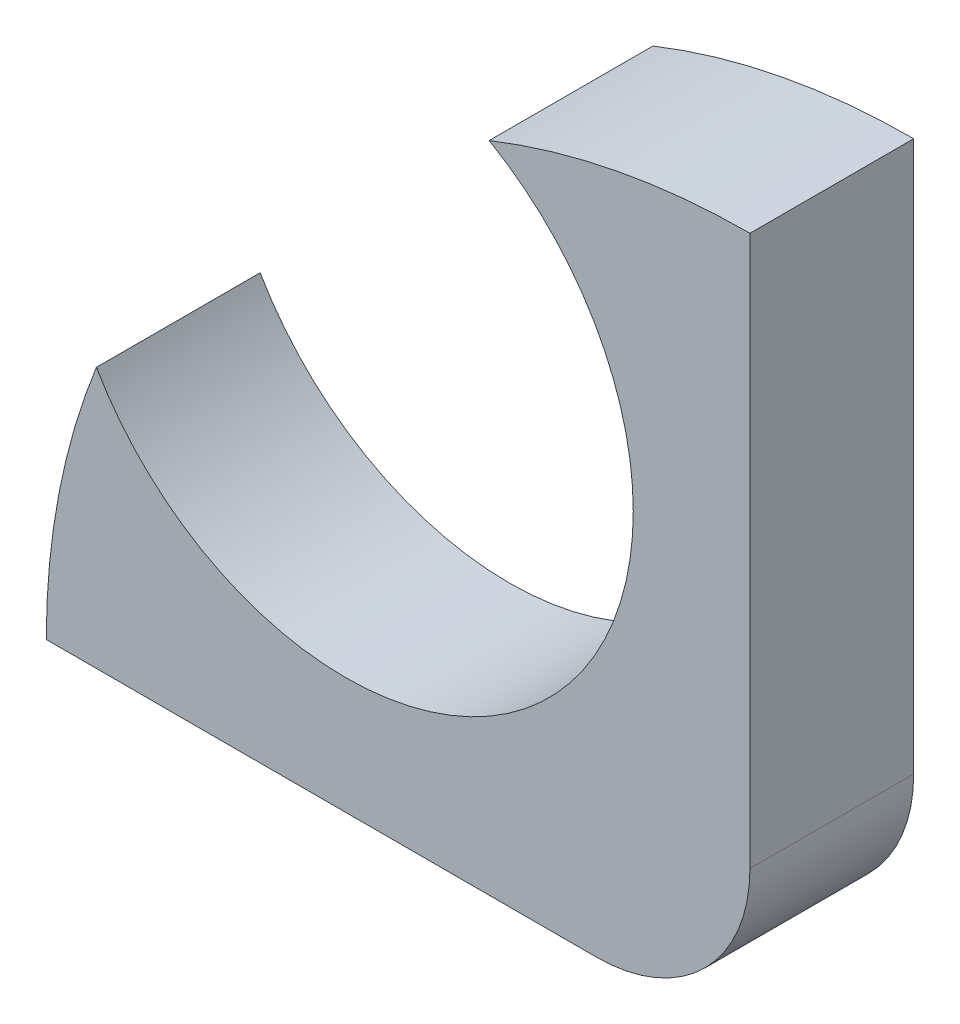
ISO-10303-21;
HEADER;
FILE_DESCRIPTION(('STEP AP214'),'2;1');
FILE_NAME('part.step','',(''),(''),'','','');
FILE_SCHEMA(('AUTOMOTIVE_DESIGN { 1 0 10303 214 1 1 1 1 }'));
ENDSEC;
DATA;
#1=APPLICATION_CONTEXT('core data for automotive mechanical design processes');
#2=APPLICATION_PROTOCOL_DEFINITION('international standard','automotive_design',2000,#1);
#3=PRODUCT_CONTEXT('',#1,'mechanical');
#4=PRODUCT('Part','Part','',(#3));
#5=PRODUCT_RELATED_PRODUCT_CATEGORY('part','',(#4));
#6=PRODUCT_DEFINITION_FORMATION('','',#4);
#7=PRODUCT_DEFINITION_CONTEXT('part definition',#1,'design');
#8=PRODUCT_DEFINITION('design','',#6,#7);
#9=PRODUCT_DEFINITION_SHAPE('','',#8);
#10=(LENGTH_UNIT() NAMED_UNIT(*) SI_UNIT(.MILLI.,.METRE.));
#11=(NAMED_UNIT(*) PLANE_ANGLE_UNIT() SI_UNIT($,.RADIAN.));
#12=(NAMED_UNIT(*) SI_UNIT($,.STERADIAN.) SOLID_ANGLE_UNIT());
#13=UNCERTAINTY_MEASURE_WITH_UNIT(LENGTH_MEASURE(1.E-05),#10,'distance_accuracy_value','');
#14=(GEOMETRIC_REPRESENTATION_CONTEXT(3) GLOBAL_UNCERTAINTY_ASSIGNED_CONTEXT((#13)) GLOBAL_UNIT_ASSIGNED_CONTEXT((#10,
#11,#12)) REPRESENTATION_CONTEXT('',''));
#15=CARTESIAN_POINT('',(0.,0.,0.));
#16=DIRECTION('',(0.,0.,1.));
#17=DIRECTION('',(1.,0.,0.));
#18=AXIS2_PLACEMENT_3D('',#15,#16,#17);
#19=CARTESIAN_POINT('',(19.95,-19.95,18.95));
#20=DIRECTION('',(0.,0.,1.));
#21=DIRECTION('',(1.,0.,0.));
#22=AXIS2_PLACEMENT_3D('',#19,#20,#21);
#23=PLANE('',#22);
#24=CARTESIAN_POINT('',(19.95,-19.95,18.95));
#25=DIRECTION('',(0.,0.,1.));
#26=DIRECTION('',(1.,0.,0.));
#27=AXIS2_PLACEMENT_3D('',#24,#25,#26);
#28=CIRCLE('',#27,6.875);
#29=CARTESIAN_POINT('',(13.5646574803851,-17.4018583423997,18.95));
#30=VERTEX_POINT('',#29);
#31=CARTESIAN_POINT('',(13.075,-19.95,18.95));
#32=VERTEX_POINT('',#31);
#33=EDGE_CURVE('E136',#30,#32,#28,.T.);
#34=ORIENTED_EDGE('',*,*,#33,.F.);
#35=CARTESIAN_POINT('',(16.,-16.,18.95));
#36=DIRECTION('',(0.,0.,-1.));
#37=DIRECTION('',(1.,0.,0.));
#38=AXIS2_PLACEMENT_3D('',#35,#36,#37);
#39=CIRCLE('',#38,2.81);
#40=CARTESIAN_POINT('',(17.4018583423997,-13.5646574803851,18.95));
#41=VERTEX_POINT('',#40);
#42=EDGE_CURVE('E27',#41,#30,#39,.T.);
#43=ORIENTED_EDGE('',*,*,#42,.F.);
#44=CARTESIAN_POINT('',(19.95,-19.95,18.95));
#45=DIRECTION('',(0.,0.,1.));
#46=DIRECTION('',(1.,0.,0.));
#47=AXIS2_PLACEMENT_3D('',#44,#45,#46);
#48=CIRCLE('',#47,6.875);
#49=CARTESIAN_POINT('',(19.95,-13.075,18.95));
#50=VERTEX_POINT('',#49);
#51=EDGE_CURVE('E97',#50,#41,#48,.T.);
#52=ORIENTED_EDGE('',*,*,#51,.F.);
#53=DIRECTION('',(0.,1.,0.));
#54=VECTOR('',#53,1.);
#55=CARTESIAN_POINT('',(19.95,-18.45,18.95));
#56=LINE('',#55,#54);
#57=CARTESIAN_POINT('',(19.95,-18.45,18.95));
#58=VERTEX_POINT('',#57);
#59=EDGE_CURVE('E108',#58,#50,#56,.T.);
#60=ORIENTED_EDGE('',*,*,#59,.F.);
#61=CARTESIAN_POINT('',(18.45,-18.45,18.95));
#62=DIRECTION('',(0.,0.,1.));
#63=DIRECTION('',(1.,0.,0.));
#64=AXIS2_PLACEMENT_3D('',#61,#62,#63);
#65=CIRCLE('',#64,1.5);
#66=CARTESIAN_POINT('',(18.45,-19.95,18.95));
#67=VERTEX_POINT('',#66);
#68=EDGE_CURVE('E20',#67,#58,#65,.T.);
#69=ORIENTED_EDGE('',*,*,#68,.F.);
#70=DIRECTION('',(1.,0.,0.));
#71=VECTOR('',#70,1.);
#72=CARTESIAN_POINT('',(13.075,-19.95,18.95));
#73=LINE('',#72,#71);
#74=EDGE_CURVE('E127',#32,#67,#73,.T.);
#75=ORIENTED_EDGE('',*,*,#74,.F.);
#76=EDGE_LOOP('',(#34,#43,#52,#60,#69,#75));
#77=FACE_BOUND('',#76,.T.);
#78=ADVANCED_FACE('F16',(#77),#23,.F.);
#79=CARTESIAN_POINT('',(19.95,-19.95,20.55));
#80=DIRECTION('',(0.,0.,1.));
#81=DIRECTION('',(1.,0.,0.));
#82=AXIS2_PLACEMENT_3D('',#79,#80,#81);
#83=PLANE('',#82);
#84=CARTESIAN_POINT('',(19.95,-19.95,20.55));
#85=DIRECTION('',(0.,0.,1.));
#86=DIRECTION('',(1.,0.,0.));
#87=AXIS2_PLACEMENT_3D('',#84,#85,#86);
#88=CIRCLE('',#87,6.875);
#89=CARTESIAN_POINT('',(13.5646574803851,-17.4018583423997,20.55));
#90=VERTEX_POINT('',#89);
#91=CARTESIAN_POINT('',(13.075,-19.95,20.55));
#92=VERTEX_POINT('',#91);
#93=EDGE_CURVE('E128',#90,#92,#88,.T.);
#94=ORIENTED_EDGE('',*,*,#93,.T.);
#95=DIRECTION('',(1.,0.,0.));
#96=VECTOR('',#95,1.);
#97=CARTESIAN_POINT('',(13.075,-19.95,20.55));
#98=LINE('',#97,#96);
#99=CARTESIAN_POINT('',(18.45,-19.95,20.55));
#100=VERTEX_POINT('',#99);
#101=EDGE_CURVE('E103',#92,#100,#98,.T.);
#102=ORIENTED_EDGE('',*,*,#101,.T.);
#103=CARTESIAN_POINT('',(18.45,-18.45,20.55));
#104=DIRECTION('',(0.,0.,1.));
#105=DIRECTION('',(1.,0.,0.));
#106=AXIS2_PLACEMENT_3D('',#103,#104,#105);
#107=CIRCLE('',#106,1.5);
#108=CARTESIAN_POINT('',(19.95,-18.45,20.55));
#109=VERTEX_POINT('',#108);
#110=EDGE_CURVE('E100',#100,#109,#107,.T.);
#111=ORIENTED_EDGE('',*,*,#110,.T.);
#112=DIRECTION('',(0.,1.,0.));
#113=VECTOR('',#112,1.);
#114=CARTESIAN_POINT('',(19.95,-18.45,20.55));
#115=LINE('',#114,#113);
#116=CARTESIAN_POINT('',(19.95,-13.075,20.55));
#117=VERTEX_POINT('',#116);
#118=EDGE_CURVE('E86',#109,#117,#115,.T.);
#119=ORIENTED_EDGE('',*,*,#118,.T.);
#120=CARTESIAN_POINT('',(19.95,-19.95,20.55));
#121=DIRECTION('',(0.,0.,1.));
#122=DIRECTION('',(1.,0.,0.));
#123=AXIS2_PLACEMENT_3D('',#120,#121,#122);
#124=CIRCLE('',#123,6.875);
#125=CARTESIAN_POINT('',(17.4018583423997,-13.5646574803851,20.55));
#126=VERTEX_POINT('',#125);
#127=EDGE_CURVE('E131',#117,#126,#124,.T.);
#128=ORIENTED_EDGE('',*,*,#127,.T.);
#129=CARTESIAN_POINT('',(16.,-16.,20.55));
#130=DIRECTION('',(0.,0.,-1.));
#131=DIRECTION('',(1.,0.,0.));
#132=AXIS2_PLACEMENT_3D('',#129,#130,#131);
#133=CIRCLE('',#132,2.81);
#134=EDGE_CURVE('E11',#126,#90,#133,.T.);
#135=ORIENTED_EDGE('',*,*,#134,.T.);
#136=EDGE_LOOP('',(#94,#102,#111,#119,#128,#135));
#137=FACE_BOUND('',#136,.T.);
#138=ADVANCED_FACE('F102',(#137),#83,.T.);
#139=CARTESIAN_POINT('',(16.,-16.,20.55));
#140=DIRECTION('',(0.,0.,-1.));
#141=DIRECTION('',(-1.,0.,0.));
#142=AXIS2_PLACEMENT_3D('',#139,#140,#141);
#143=CYLINDRICAL_SURFACE('',#142,2.81);
#144=ORIENTED_EDGE('',*,*,#42,.T.);
#145=DIRECTION('',(0.,0.,-1.));
#146=VECTOR('',#145,1.);
#147=CARTESIAN_POINT('',(13.5646574803851,-17.4018583423997,20.55));
#148=LINE('',#147,#146);
#149=EDGE_CURVE('E123',#90,#30,#148,.T.);
#150=ORIENTED_EDGE('',*,*,#149,.F.);
#151=ORIENTED_EDGE('',*,*,#134,.F.);
#152=DIRECTION('',(0.,0.,-1.));
#153=VECTOR('',#152,1.);
#154=CARTESIAN_POINT('',(17.4018583423997,-13.5646574803851,20.55));
#155=LINE('',#154,#153);
#156=EDGE_CURVE('E122',#126,#41,#155,.T.);
#157=ORIENTED_EDGE('',*,*,#156,.T.);
#158=EDGE_LOOP('',(#144,#150,#151,#157));
#159=FACE_BOUND('',#158,.T.);
#160=ADVANCED_FACE('F167',(#159),#143,.F.);
#161=CARTESIAN_POINT('',(19.95,-19.95,20.55));
#162=DIRECTION('',(0.,0.,-1.));
#163=DIRECTION('',(-1.,0.,0.));
#164=AXIS2_PLACEMENT_3D('',#161,#162,#163);
#165=CYLINDRICAL_SURFACE('',#164,6.875);
#166=ORIENTED_EDGE('',*,*,#51,.T.);
#167=ORIENTED_EDGE('',*,*,#156,.F.);
#168=ORIENTED_EDGE('',*,*,#127,.F.);
#169=DIRECTION('',(0.,0.,-1.));
#170=VECTOR('',#169,1.);
#171=CARTESIAN_POINT('',(19.95,-13.075,20.55));
#172=LINE('',#171,#170);
#173=EDGE_CURVE('E94',#117,#50,#172,.T.);
#174=ORIENTED_EDGE('',*,*,#173,.T.);
#175=EDGE_LOOP('',(#166,#167,#168,#174));
#176=FACE_BOUND('',#175,.T.);
#177=ADVANCED_FACE('F18',(#176),#165,.T.);
#178=CARTESIAN_POINT('',(19.95,-18.45,20.55));
#179=DIRECTION('',(-1.,0.,0.));
#180=DIRECTION('',(0.,0.,1.));
#181=AXIS2_PLACEMENT_3D('',#178,#179,#180);
#182=PLANE('',#181);
#183=ORIENTED_EDGE('',*,*,#59,.T.);
#184=ORIENTED_EDGE('',*,*,#173,.F.);
#185=ORIENTED_EDGE('',*,*,#118,.F.);
#186=DIRECTION('',(0.,0.,-1.));
#187=VECTOR('',#186,1.);
#188=CARTESIAN_POINT('',(19.95,-18.45,20.55));
#189=LINE('',#188,#187);
#190=EDGE_CURVE('E91',#109,#58,#189,.T.);
#191=ORIENTED_EDGE('',*,*,#190,.T.);
#192=EDGE_LOOP('',(#183,#184,#185,#191));
#193=FACE_BOUND('',#192,.T.);
#194=ADVANCED_FACE('F89',(#193),#182,.F.);
#195=CARTESIAN_POINT('',(18.45,-18.45,20.55));
#196=DIRECTION('',(0.,0.,-1.));
#197=DIRECTION('',(-1.,0.,0.));
#198=AXIS2_PLACEMENT_3D('',#195,#196,#197);
#199=CYLINDRICAL_SURFACE('',#198,1.5);
#200=ORIENTED_EDGE('',*,*,#68,.T.);
#201=ORIENTED_EDGE('',*,*,#190,.F.);
#202=ORIENTED_EDGE('',*,*,#110,.F.);
#203=DIRECTION('',(0.,0.,-1.));
#204=VECTOR('',#203,1.);
#205=CARTESIAN_POINT('',(18.45,-19.95,20.55));
#206=LINE('',#205,#204);
#207=EDGE_CURVE('E135',#100,#67,#206,.T.);
#208=ORIENTED_EDGE('',*,*,#207,.T.);
#209=EDGE_LOOP('',(#200,#201,#202,#208));
#210=FACE_BOUND('',#209,.T.);
#211=ADVANCED_FACE('F110',(#210),#199,.T.);
#212=CARTESIAN_POINT('',(13.075,-19.95,20.55));
#213=DIRECTION('',(0.,1.,0.));
#214=DIRECTION('',(1.,0.,0.));
#215=AXIS2_PLACEMENT_3D('',#212,#213,#214);
#216=PLANE('',#215);
#217=ORIENTED_EDGE('',*,*,#74,.T.);
#218=ORIENTED_EDGE('',*,*,#207,.F.);
#219=ORIENTED_EDGE('',*,*,#101,.F.);
#220=DIRECTION('',(0.,0.,-1.));
#221=VECTOR('',#220,1.);
#222=CARTESIAN_POINT('',(13.075,-19.95,20.55));
#223=LINE('',#222,#221);
#224=EDGE_CURVE('E140',#92,#32,#223,.T.);
#225=ORIENTED_EDGE('',*,*,#224,.T.);
#226=EDGE_LOOP('',(#217,#218,#219,#225));
#227=FACE_BOUND('',#226,.T.);
#228=ADVANCED_FACE('F185',(#227),#216,.F.);
#229=CARTESIAN_POINT('',(19.95,-19.95,20.55));
#230=DIRECTION('',(0.,0.,-1.));
#231=DIRECTION('',(-1.,0.,0.));
#232=AXIS2_PLACEMENT_3D('',#229,#230,#231);
#233=CYLINDRICAL_SURFACE('',#232,6.875);
#234=ORIENTED_EDGE('',*,*,#33,.T.);
#235=ORIENTED_EDGE('',*,*,#224,.F.);
#236=ORIENTED_EDGE('',*,*,#93,.F.);
#237=ORIENTED_EDGE('',*,*,#149,.T.);
#238=EDGE_LOOP('',(#234,#235,#236,#237));
#239=FACE_BOUND('',#238,.T.);
#240=ADVANCED_FACE('F183',(#239),#233,.T.);
#241=CLOSED_SHELL('',(#78,#138,#160,#177,#194,#211,#228,#240));
#242=MANIFOLD_SOLID_BREP('B1',#241);
#243=ADVANCED_BREP_SHAPE_REPRESENTATION('',(#18,#242),#14);
#244=SHAPE_DEFINITION_REPRESENTATION(#9,#243);
ENDSEC;
END-ISO-10303-21;
